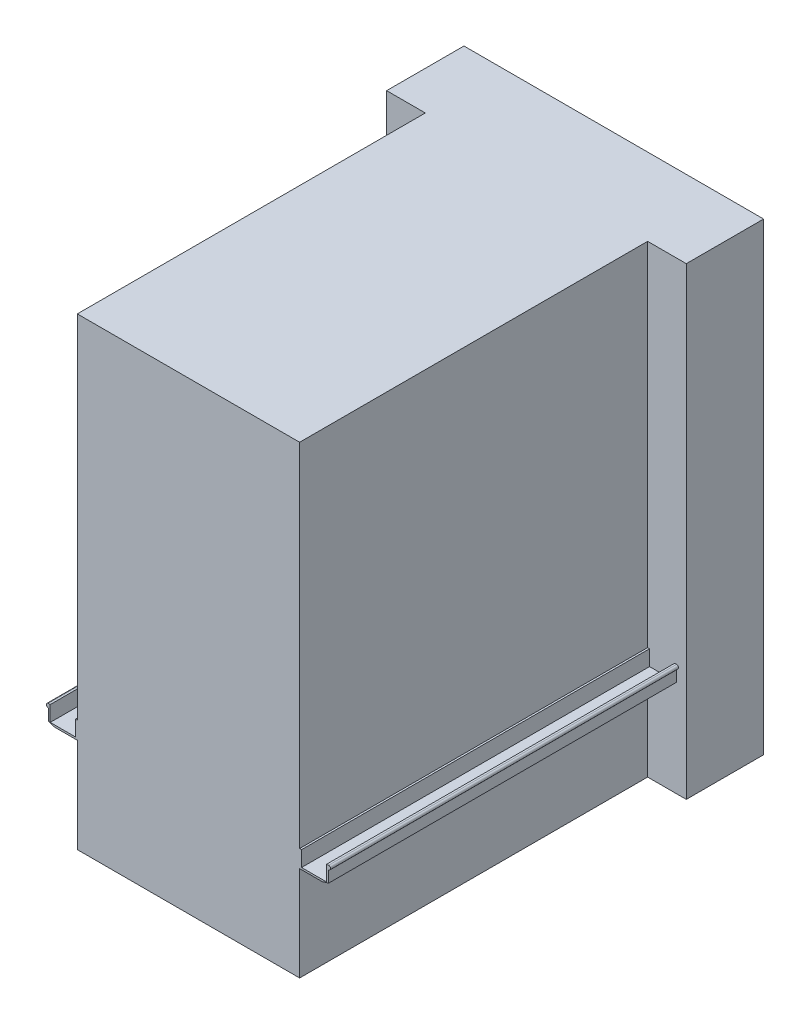
ISO-10303-21;
HEADER;
FILE_DESCRIPTION(('STEP AP214'),'2;1');
FILE_NAME('part.step','',(''),(''),'','','');
FILE_SCHEMA(('AUTOMOTIVE_DESIGN { 1 0 10303 214 1 1 1 1 }'));
ENDSEC;
DATA;
#1=APPLICATION_CONTEXT('core data for automotive mechanical design processes');
#2=APPLICATION_PROTOCOL_DEFINITION('international standard','automotive_design',2000,#1);
#3=PRODUCT_CONTEXT('',#1,'mechanical');
#4=PRODUCT('Part','Part','',(#3));
#5=PRODUCT_RELATED_PRODUCT_CATEGORY('part','',(#4));
#6=PRODUCT_DEFINITION_FORMATION('','',#4);
#7=PRODUCT_DEFINITION_CONTEXT('part definition',#1,'design');
#8=PRODUCT_DEFINITION('design','',#6,#7);
#9=PRODUCT_DEFINITION_SHAPE('','',#8);
#10=(LENGTH_UNIT() NAMED_UNIT(*) SI_UNIT(.MILLI.,.METRE.));
#11=(NAMED_UNIT(*) PLANE_ANGLE_UNIT() SI_UNIT($,.RADIAN.));
#12=(NAMED_UNIT(*) SI_UNIT($,.STERADIAN.) SOLID_ANGLE_UNIT());
#13=UNCERTAINTY_MEASURE_WITH_UNIT(LENGTH_MEASURE(1.E-05),#10,'distance_accuracy_value','');
#14=(GEOMETRIC_REPRESENTATION_CONTEXT(3) GLOBAL_UNCERTAINTY_ASSIGNED_CONTEXT((#13)) GLOBAL_UNIT_ASSIGNED_CONTEXT((#10,
#11,#12)) REPRESENTATION_CONTEXT('',''));
#15=CARTESIAN_POINT('',(0.,0.,0.));
#16=DIRECTION('',(0.,0.,1.));
#17=DIRECTION('',(1.,0.,0.));
#18=AXIS2_PLACEMENT_3D('',#15,#16,#17);
#19=CARTESIAN_POINT('',(0.,329.458185741184,1800.));
#20=DIRECTION('',(0.,1.,0.));
#21=DIRECTION('',(0.,0.,1.));
#22=AXIS2_PLACEMENT_3D('',#19,#20,#21);
#23=PLANE('',#22);
#24=DIRECTION('',(1.,0.,0.));
#25=VECTOR('',#24,1.);
#26=CARTESIAN_POINT('',(0.,329.458185741184,0.));
#27=LINE('',#26,#25);
#28=CARTESIAN_POINT('',(-724.999999999999,329.458185741184,0.));
#29=VERTEX_POINT('',#28);
#30=CARTESIAN_POINT('',(-715.049185759595,329.458185741184,0.));
#31=VERTEX_POINT('',#30);
#32=EDGE_CURVE('E243',#29,#31,#27,.T.);
#33=ORIENTED_EDGE('',*,*,#32,.F.);
#34=DIRECTION('',(0.,0.,-1.));
#35=VECTOR('',#34,1.);
#36=CARTESIAN_POINT('',(-724.999999999999,329.458185741184,1800.));
#37=LINE('',#36,#35);
#38=CARTESIAN_POINT('',(-724.999999999999,329.458185741184,1800.));
#39=VERTEX_POINT('',#38);
#40=EDGE_CURVE('E11',#39,#29,#37,.T.);
#41=ORIENTED_EDGE('',*,*,#40,.F.);
#42=DIRECTION('',(1.,0.,0.));
#43=VECTOR('',#42,1.);
#44=CARTESIAN_POINT('',(0.,329.458185741184,1800.));
#45=LINE('',#44,#43);
#46=CARTESIAN_POINT('',(-715.049185759595,329.458185741184,1800.));
#47=VERTEX_POINT('',#46);
#48=EDGE_CURVE('E251',#39,#47,#45,.T.);
#49=ORIENTED_EDGE('',*,*,#48,.T.);
#50=DIRECTION('',(0.,0.,-1.));
#51=VECTOR('',#50,1.);
#52=CARTESIAN_POINT('',(-715.049185759595,329.458185741184,1800.));
#53=LINE('',#52,#51);
#54=EDGE_CURVE('E50',#47,#31,#53,.T.);
#55=ORIENTED_EDGE('',*,*,#54,.T.);
#56=EDGE_LOOP('',(#33,#41,#49,#55));
#57=FACE_BOUND('',#56,.T.);
#58=ADVANCED_FACE('F35',(#57),#23,.T.);
#59=CARTESIAN_POINT('',(-724.999999999999,319.458185741184,1800.));
#60=DIRECTION('',(0.,0.,-1.));
#61=DIRECTION('',(-1.,0.,0.));
#62=AXIS2_PLACEMENT_3D('',#59,#60,#61);
#63=CYLINDRICAL_SURFACE('',#62,10.);
#64=CARTESIAN_POINT('',(-724.999999999999,319.458185741184,0.));
#65=DIRECTION('',(0.,0.,1.));
#66=DIRECTION('',(1.,0.,0.));
#67=AXIS2_PLACEMENT_3D('',#64,#65,#66);
#68=CIRCLE('',#67,10.);
#69=CARTESIAN_POINT('',(-724.999999999999,309.458185741184,0.));
#70=VERTEX_POINT('',#69);
#71=EDGE_CURVE('E245',#29,#70,#68,.T.);
#72=ORIENTED_EDGE('',*,*,#71,.T.);
#73=DIRECTION('',(0.,0.,-1.));
#74=VECTOR('',#73,1.);
#75=CARTESIAN_POINT('',(-724.999999999999,309.458185741184,1800.));
#76=LINE('',#75,#74);
#77=CARTESIAN_POINT('',(-724.999999999999,309.458185741184,1800.));
#78=VERTEX_POINT('',#77);
#79=EDGE_CURVE('E43',#78,#70,#76,.T.);
#80=ORIENTED_EDGE('',*,*,#79,.F.);
#81=CARTESIAN_POINT('',(-724.999999999999,319.458185741184,1800.));
#82=DIRECTION('',(0.,0.,1.));
#83=DIRECTION('',(1.,0.,0.));
#84=AXIS2_PLACEMENT_3D('',#81,#82,#83);
#85=CIRCLE('',#84,10.);
#86=EDGE_CURVE('E253',#39,#78,#85,.T.);
#87=ORIENTED_EDGE('',*,*,#86,.F.);
#88=ORIENTED_EDGE('',*,*,#40,.T.);
#89=EDGE_LOOP('',(#72,#80,#87,#88));
#90=FACE_BOUND('',#89,.T.);
#91=ADVANCED_FACE('F432',(#90),#63,.T.);
#92=CARTESIAN_POINT('',(-724.999999999999,0.,1800.));
#93=DIRECTION('',(1.,0.,0.));
#94=DIRECTION('',(0.,0.,-1.));
#95=AXIS2_PLACEMENT_3D('',#92,#93,#94);
#96=PLANE('',#95);
#97=DIRECTION('',(0.,-1.,0.));
#98=VECTOR('',#97,1.);
#99=CARTESIAN_POINT('',(-724.999999999999,0.,0.));
#100=LINE('',#99,#98);
#101=CARTESIAN_POINT('',(-724.999999999999,249.458185741184,0.));
#102=VERTEX_POINT('',#101);
#103=EDGE_CURVE('E312',#70,#102,#100,.T.);
#104=ORIENTED_EDGE('',*,*,#103,.T.);
#105=DIRECTION('',(0.,0.,-1.));
#106=VECTOR('',#105,1.);
#107=CARTESIAN_POINT('',(-724.999999999999,249.458185741184,1800.));
#108=LINE('',#107,#106);
#109=CARTESIAN_POINT('',(-724.999999999999,249.458185741184,1800.));
#110=VERTEX_POINT('',#109);
#111=EDGE_CURVE('E421',#110,#102,#108,.T.);
#112=ORIENTED_EDGE('',*,*,#111,.F.);
#113=DIRECTION('',(0.,-1.,0.));
#114=VECTOR('',#113,1.);
#115=CARTESIAN_POINT('',(-724.999999999999,0.,1800.));
#116=LINE('',#115,#114);
#117=EDGE_CURVE('E256',#78,#110,#116,.T.);
#118=ORIENTED_EDGE('',*,*,#117,.F.);
#119=ORIENTED_EDGE('',*,*,#79,.T.);
#120=EDGE_LOOP('',(#104,#112,#118,#119));
#121=FACE_BOUND('',#120,.T.);
#122=ADVANCED_FACE('F427',(#121),#96,.F.);
#123=CARTESIAN_POINT('',(8.21719993486013,27.0953165389469,1800.));
#124=DIRECTION('',(0.290217583337057,0.956960685881086,0.));
#125=DIRECTION('',(-0.956960685881086,0.290217583337057,0.));
#126=AXIS2_PLACEMENT_3D('',#123,#124,#125);
#127=PLANE('',#126);
#128=DIRECTION('',(0.956960685881086,-0.290217583337057,0.));
#129=VECTOR('',#128,1.);
#130=CARTESIAN_POINT('',(8.21719993486013,27.0953165389469,0.));
#131=LINE('',#130,#129);
#132=CARTESIAN_POINT('',(-692.026095563283,239.458185741184,0.));
#133=VERTEX_POINT('',#132);
#134=EDGE_CURVE('E315',#102,#133,#131,.T.);
#135=ORIENTED_EDGE('',*,*,#134,.T.);
#136=DIRECTION('',(0.,0.,-1.));
#137=VECTOR('',#136,1.);
#138=CARTESIAN_POINT('',(-692.026095563283,239.458185741184,1800.));
#139=LINE('',#138,#137);
#140=CARTESIAN_POINT('',(-692.026095563283,239.458185741184,1800.));
#141=VERTEX_POINT('',#140);
#142=EDGE_CURVE('E418',#141,#133,#139,.T.);
#143=ORIENTED_EDGE('',*,*,#142,.F.);
#144=DIRECTION('',(0.956960685881086,-0.290217583337057,0.));
#145=VECTOR('',#144,1.);
#146=CARTESIAN_POINT('',(8.21719993486013,27.0953165389469,1800.));
#147=LINE('',#146,#145);
#148=EDGE_CURVE('E258',#110,#141,#147,.T.);
#149=ORIENTED_EDGE('',*,*,#148,.F.);
#150=ORIENTED_EDGE('',*,*,#111,.T.);
#151=EDGE_LOOP('',(#135,#143,#149,#150));
#152=FACE_BOUND('',#151,.T.);
#153=ADVANCED_FACE('F439',(#152),#127,.F.);
#154=CARTESIAN_POINT('',(0.,239.458185741184,1800.));
#155=DIRECTION('',(0.,1.,0.));
#156=DIRECTION('',(0.,0.,1.));
#157=AXIS2_PLACEMENT_3D('',#154,#155,#156);
#158=PLANE('',#157);
#159=DIRECTION('',(1.,0.,0.));
#160=VECTOR('',#159,1.);
#161=CARTESIAN_POINT('',(0.,239.458185741184,0.));
#162=LINE('',#161,#160);
#163=CARTESIAN_POINT('',(-575.,239.458185741184,0.));
#164=VERTEX_POINT('',#163);
#165=EDGE_CURVE('E318',#133,#164,#162,.T.);
#166=ORIENTED_EDGE('',*,*,#165,.T.);
#167=DIRECTION('',(0.,0.,-1.));
#168=VECTOR('',#167,1.);
#169=CARTESIAN_POINT('',(-575.,239.458185741184,1800.));
#170=LINE('',#169,#168);
#171=CARTESIAN_POINT('',(-575.,239.458185741184,1800.));
#172=VERTEX_POINT('',#171);
#173=EDGE_CURVE('E415',#172,#164,#170,.T.);
#174=ORIENTED_EDGE('',*,*,#173,.F.);
#175=DIRECTION('',(1.,0.,0.));
#176=VECTOR('',#175,1.);
#177=CARTESIAN_POINT('',(0.,239.458185741184,1800.));
#178=LINE('',#177,#176);
#179=EDGE_CURVE('E260',#141,#172,#178,.T.);
#180=ORIENTED_EDGE('',*,*,#179,.F.);
#181=ORIENTED_EDGE('',*,*,#142,.T.);
#182=EDGE_LOOP('',(#166,#174,#180,#181));
#183=FACE_BOUND('',#182,.T.);
#184=ADVANCED_FACE('F443',(#183),#158,.F.);
#185=CARTESIAN_POINT('',(-575.,-2.605625465957E-13,1800.));
#186=DIRECTION('',(1.,0.,0.));
#187=DIRECTION('',(0.,1.,0.));
#188=AXIS2_PLACEMENT_3D('',#185,#186,#187);
#189=PLANE('',#188);
#190=DIRECTION('',(0.,-1.,0.));
#191=VECTOR('',#190,1.);
#192=CARTESIAN_POINT('',(-575.,-2.605625465957E-13,0.));
#193=LINE('',#192,#191);
#194=CARTESIAN_POINT('',(-575.,-250.541814258816,0.));
#195=VERTEX_POINT('',#194);
#196=EDGE_CURVE('E321',#164,#195,#193,.T.);
#197=ORIENTED_EDGE('',*,*,#196,.T.);
#198=DIRECTION('',(0.,0.,-1.));
#199=VECTOR('',#198,1.);
#200=CARTESIAN_POINT('',(-575.,-250.541814258816,1800.));
#201=LINE('',#200,#199);
#202=CARTESIAN_POINT('',(-575.,-250.541814258816,1800.));
#203=VERTEX_POINT('',#202);
#204=EDGE_CURVE('E412',#203,#195,#201,.T.);
#205=ORIENTED_EDGE('',*,*,#204,.F.);
#206=DIRECTION('',(0.,-1.,0.));
#207=VECTOR('',#206,1.);
#208=CARTESIAN_POINT('',(-575.,-2.605625465957E-13,1800.));
#209=LINE('',#208,#207);
#210=EDGE_CURVE('E262',#172,#203,#209,.T.);
#211=ORIENTED_EDGE('',*,*,#210,.F.);
#212=ORIENTED_EDGE('',*,*,#173,.T.);
#213=EDGE_LOOP('',(#197,#205,#211,#212));
#214=FACE_BOUND('',#213,.T.);
#215=ADVANCED_FACE('F557',(#214),#189,.F.);
#216=CARTESIAN_POINT('',(0.,-250.541814258816,1800.));
#217=DIRECTION('',(0.,1.,0.));
#218=DIRECTION('',(-1.,0.,0.));
#219=AXIS2_PLACEMENT_3D('',#216,#217,#218);
#220=PLANE('',#219);
#221=ORIENTED_EDGE('',*,*,#204,.T.);
#222=DIRECTION('',(-1.,0.,0.));
#223=VECTOR('',#222,1.);
#224=CARTESIAN_POINT('',(775.,-250.541814258816,0.));
#225=LINE('',#224,#223);
#226=CARTESIAN_POINT('',(-775.,-250.541814258816,0.));
#227=VERTEX_POINT('',#226);
#228=EDGE_CURVE('E486',#195,#227,#225,.T.);
#229=ORIENTED_EDGE('',*,*,#228,.T.);
#230=DIRECTION('',(0.,0.,1.));
#231=VECTOR('',#230,1.);
#232=CARTESIAN_POINT('',(-775.,-250.541814258816,-400.));
#233=LINE('',#232,#231);
#234=CARTESIAN_POINT('',(-775.,-250.541814258816,-400.));
#235=VERTEX_POINT('',#234);
#236=EDGE_CURVE('E489',#235,#227,#233,.T.);
#237=ORIENTED_EDGE('',*,*,#236,.F.);
#238=DIRECTION('',(-1.,0.,0.));
#239=VECTOR('',#238,1.);
#240=CARTESIAN_POINT('',(775.,-250.541814258816,-400.));
#241=LINE('',#240,#239);
#242=CARTESIAN_POINT('',(775.,-250.541814258816,-400.));
#243=VERTEX_POINT('',#242);
#244=EDGE_CURVE('E234',#243,#235,#241,.T.);
#245=ORIENTED_EDGE('',*,*,#244,.F.);
#246=DIRECTION('',(0.,0.,1.));
#247=VECTOR('',#246,1.);
#248=CARTESIAN_POINT('',(775.,-250.541814258816,-400.));
#249=LINE('',#248,#247);
#250=CARTESIAN_POINT('',(775.,-250.541814258816,0.));
#251=VERTEX_POINT('',#250);
#252=EDGE_CURVE('E247',#243,#251,#249,.T.);
#253=ORIENTED_EDGE('',*,*,#252,.T.);
#254=CARTESIAN_POINT('',(575.,-250.541814258816,0.));
#255=VERTEX_POINT('',#254);
#256=EDGE_CURVE('E238',#251,#255,#225,.T.);
#257=ORIENTED_EDGE('',*,*,#256,.T.);
#258=DIRECTION('',(0.,0.,-1.));
#259=VECTOR('',#258,1.);
#260=CARTESIAN_POINT('',(575.,-250.541814258816,1800.));
#261=LINE('',#260,#259);
#262=CARTESIAN_POINT('',(575.,-250.541814258816,1800.));
#263=VERTEX_POINT('',#262);
#264=EDGE_CURVE('E409',#263,#255,#261,.T.);
#265=ORIENTED_EDGE('',*,*,#264,.F.);
#266=DIRECTION('',(1.,0.,0.));
#267=VECTOR('',#266,1.);
#268=CARTESIAN_POINT('',(0.,-250.541814258816,1800.));
#269=LINE('',#268,#267);
#270=EDGE_CURVE('E264',#203,#263,#269,.T.);
#271=ORIENTED_EDGE('',*,*,#270,.F.);
#272=EDGE_LOOP('',(#221,#229,#237,#245,#253,#257,#265,#271));
#273=FACE_BOUND('',#272,.T.);
#274=ADVANCED_FACE('F493',(#273),#220,.F.);
#275=CARTESIAN_POINT('',(575.,-2.605625465957E-13,1800.));
#276=DIRECTION('',(1.,0.,0.));
#277=DIRECTION('',(0.,1.,0.));
#278=AXIS2_PLACEMENT_3D('',#275,#276,#277);
#279=PLANE('',#278);
#280=DIRECTION('',(0.,-1.,0.));
#281=VECTOR('',#280,1.);
#282=CARTESIAN_POINT('',(575.,-2.605625465957E-13,0.));
#283=LINE('',#282,#281);
#284=CARTESIAN_POINT('',(575.,239.458185741184,0.));
#285=VERTEX_POINT('',#284);
#286=EDGE_CURVE('E324',#285,#255,#283,.T.);
#287=ORIENTED_EDGE('',*,*,#286,.F.);
#288=DIRECTION('',(0.,0.,-1.));
#289=VECTOR('',#288,1.);
#290=CARTESIAN_POINT('',(575.,239.458185741184,1800.));
#291=LINE('',#290,#289);
#292=CARTESIAN_POINT('',(575.,239.458185741184,1800.));
#293=VERTEX_POINT('',#292);
#294=EDGE_CURVE('E406',#293,#285,#291,.T.);
#295=ORIENTED_EDGE('',*,*,#294,.F.);
#296=DIRECTION('',(0.,-1.,0.));
#297=VECTOR('',#296,1.);
#298=CARTESIAN_POINT('',(575.,-2.605625465957E-13,1800.));
#299=LINE('',#298,#297);
#300=EDGE_CURVE('E266',#293,#263,#299,.T.);
#301=ORIENTED_EDGE('',*,*,#300,.T.);
#302=ORIENTED_EDGE('',*,*,#264,.T.);
#303=EDGE_LOOP('',(#287,#295,#301,#302));
#304=FACE_BOUND('',#303,.T.);
#305=ADVANCED_FACE('F499',(#304),#279,.T.);
#306=CARTESIAN_POINT('',(0.,239.458185741184,1800.));
#307=DIRECTION('',(0.,-1.,0.));
#308=DIRECTION('',(1.,0.,0.));
#309=AXIS2_PLACEMENT_3D('',#306,#307,#308);
#310=PLANE('',#309);
#311=DIRECTION('',(-1.,0.,0.));
#312=VECTOR('',#311,1.);
#313=CARTESIAN_POINT('',(0.,239.458185741184,0.));
#314=LINE('',#313,#312);
#315=CARTESIAN_POINT('',(692.026095563284,239.458185741184,0.));
#316=VERTEX_POINT('',#315);
#317=EDGE_CURVE('E326',#316,#285,#314,.T.);
#318=ORIENTED_EDGE('',*,*,#317,.F.);
#319=DIRECTION('',(0.,0.,-1.));
#320=VECTOR('',#319,1.);
#321=CARTESIAN_POINT('',(692.026095563284,239.458185741184,1800.));
#322=LINE('',#321,#320);
#323=CARTESIAN_POINT('',(692.026095563284,239.458185741184,1800.));
#324=VERTEX_POINT('',#323);
#325=EDGE_CURVE('E403',#324,#316,#322,.T.);
#326=ORIENTED_EDGE('',*,*,#325,.F.);
#327=DIRECTION('',(-1.,0.,0.));
#328=VECTOR('',#327,1.);
#329=CARTESIAN_POINT('',(0.,239.458185741184,1800.));
#330=LINE('',#329,#328);
#331=EDGE_CURVE('E269',#324,#293,#330,.T.);
#332=ORIENTED_EDGE('',*,*,#331,.T.);
#333=ORIENTED_EDGE('',*,*,#294,.T.);
#334=EDGE_LOOP('',(#318,#326,#332,#333));
#335=FACE_BOUND('',#334,.T.);
#336=ADVANCED_FACE('F505',(#335),#310,.T.);
#337=CARTESIAN_POINT('',(-8.21719993486011,27.0953165389469,1800.));
#338=DIRECTION('',(0.290217583337057,-0.956960685881086,0.));
#339=DIRECTION('',(0.956960685881086,0.290217583337057,0.));
#340=AXIS2_PLACEMENT_3D('',#337,#338,#339);
#341=PLANE('',#340);
#342=DIRECTION('',(-0.956960685881086,-0.290217583337057,0.));
#343=VECTOR('',#342,1.);
#344=CARTESIAN_POINT('',(-8.21719993486011,27.0953165389469,0.));
#345=LINE('',#344,#343);
#346=CARTESIAN_POINT('',(725.,249.458185741184,0.));
#347=VERTEX_POINT('',#346);
#348=EDGE_CURVE('E328',#347,#316,#345,.T.);
#349=ORIENTED_EDGE('',*,*,#348,.F.);
#350=DIRECTION('',(0.,0.,-1.));
#351=VECTOR('',#350,1.);
#352=CARTESIAN_POINT('',(725.,249.458185741184,1800.));
#353=LINE('',#352,#351);
#354=CARTESIAN_POINT('',(725.,249.458185741184,1800.));
#355=VERTEX_POINT('',#354);
#356=EDGE_CURVE('E400',#355,#347,#353,.T.);
#357=ORIENTED_EDGE('',*,*,#356,.F.);
#358=DIRECTION('',(-0.956960685881086,-0.290217583337057,0.));
#359=VECTOR('',#358,1.);
#360=CARTESIAN_POINT('',(-8.21719993486011,27.0953165389469,1800.));
#361=LINE('',#360,#359);
#362=EDGE_CURVE('E272',#355,#324,#361,.T.);
#363=ORIENTED_EDGE('',*,*,#362,.T.);
#364=ORIENTED_EDGE('',*,*,#325,.T.);
#365=EDGE_LOOP('',(#349,#357,#363,#364));
#366=FACE_BOUND('',#365,.T.);
#367=ADVANCED_FACE('F508',(#366),#341,.T.);
#368=CARTESIAN_POINT('',(725.,0.,1800.));
#369=DIRECTION('',(1.,0.,0.));
#370=DIRECTION('',(0.,0.,-1.));
#371=AXIS2_PLACEMENT_3D('',#368,#369,#370);
#372=PLANE('',#371);
#373=DIRECTION('',(0.,-1.,0.));
#374=VECTOR('',#373,1.);
#375=CARTESIAN_POINT('',(725.,0.,0.));
#376=LINE('',#375,#374);
#377=CARTESIAN_POINT('',(725.,309.458185741184,0.));
#378=VERTEX_POINT('',#377);
#379=EDGE_CURVE('E330',#378,#347,#376,.T.);
#380=ORIENTED_EDGE('',*,*,#379,.F.);
#381=DIRECTION('',(0.,0.,-1.));
#382=VECTOR('',#381,1.);
#383=CARTESIAN_POINT('',(725.,309.458185741184,1800.));
#384=LINE('',#383,#382);
#385=CARTESIAN_POINT('',(725.,309.458185741184,1800.));
#386=VERTEX_POINT('',#385);
#387=EDGE_CURVE('E397',#386,#378,#384,.T.);
#388=ORIENTED_EDGE('',*,*,#387,.F.);
#389=DIRECTION('',(0.,-1.,0.));
#390=VECTOR('',#389,1.);
#391=CARTESIAN_POINT('',(725.,0.,1800.));
#392=LINE('',#391,#390);
#393=EDGE_CURVE('E275',#386,#355,#392,.T.);
#394=ORIENTED_EDGE('',*,*,#393,.T.);
#395=ORIENTED_EDGE('',*,*,#356,.T.);
#396=EDGE_LOOP('',(#380,#388,#394,#395));
#397=FACE_BOUND('',#396,.T.);
#398=ADVANCED_FACE('F513',(#397),#372,.T.);
#399=CARTESIAN_POINT('',(725.,319.458185741184,1800.));
#400=DIRECTION('',(0.,0.,-1.));
#401=DIRECTION('',(-1.,0.,0.));
#402=AXIS2_PLACEMENT_3D('',#399,#400,#401);
#403=CYLINDRICAL_SURFACE('',#402,10.);
#404=CARTESIAN_POINT('',(725.,319.458185741184,0.));
#405=DIRECTION('',(0.,0.,1.));
#406=DIRECTION('',(1.,0.,0.));
#407=AXIS2_PLACEMENT_3D('',#404,#405,#406);
#408=CIRCLE('',#407,10.);
#409=CARTESIAN_POINT('',(725.,329.458185741184,0.));
#410=VERTEX_POINT('',#409);
#411=EDGE_CURVE('E332',#410,#378,#408,.F.);
#412=ORIENTED_EDGE('',*,*,#411,.F.);
#413=DIRECTION('',(0.,0.,-1.));
#414=VECTOR('',#413,1.);
#415=CARTESIAN_POINT('',(725.,329.458185741184,1800.));
#416=LINE('',#415,#414);
#417=CARTESIAN_POINT('',(725.,329.458185741184,1800.));
#418=VERTEX_POINT('',#417);
#419=EDGE_CURVE('E394',#418,#410,#416,.T.);
#420=ORIENTED_EDGE('',*,*,#419,.F.);
#421=CARTESIAN_POINT('',(725.,319.458185741184,1800.));
#422=DIRECTION('',(0.,0.,1.));
#423=DIRECTION('',(1.,0.,0.));
#424=AXIS2_PLACEMENT_3D('',#421,#422,#423);
#425=CIRCLE('',#424,10.);
#426=EDGE_CURVE('E278',#418,#386,#425,.F.);
#427=ORIENTED_EDGE('',*,*,#426,.T.);
#428=ORIENTED_EDGE('',*,*,#387,.T.);
#429=EDGE_LOOP('',(#412,#420,#427,#428));
#430=FACE_BOUND('',#429,.T.);
#431=ADVANCED_FACE('F516',(#430),#403,.T.);
#432=CARTESIAN_POINT('',(0.,329.458185741184,1800.));
#433=DIRECTION('',(0.,-1.,0.));
#434=DIRECTION('',(0.,0.,-1.));
#435=AXIS2_PLACEMENT_3D('',#432,#433,#434);
#436=PLANE('',#435);
#437=DIRECTION('',(-1.,0.,0.));
#438=VECTOR('',#437,1.);
#439=CARTESIAN_POINT('',(0.,329.458185741184,0.));
#440=LINE('',#439,#438);
#441=CARTESIAN_POINT('',(715.049185759596,329.458185741184,0.));
#442=VERTEX_POINT('',#441);
#443=EDGE_CURVE('E334',#410,#442,#440,.T.);
#444=ORIENTED_EDGE('',*,*,#443,.T.);
#445=DIRECTION('',(0.,0.,-1.));
#446=VECTOR('',#445,1.);
#447=CARTESIAN_POINT('',(715.049185759596,329.458185741184,1800.));
#448=LINE('',#447,#446);
#449=CARTESIAN_POINT('',(715.049185759596,329.458185741184,1800.));
#450=VERTEX_POINT('',#449);
#451=EDGE_CURVE('E391',#450,#442,#448,.T.);
#452=ORIENTED_EDGE('',*,*,#451,.F.);
#453=DIRECTION('',(-1.,0.,0.));
#454=VECTOR('',#453,1.);
#455=CARTESIAN_POINT('',(0.,329.458185741184,1800.));
#456=LINE('',#455,#454);
#457=EDGE_CURVE('E281',#418,#450,#456,.T.);
#458=ORIENTED_EDGE('',*,*,#457,.F.);
#459=ORIENTED_EDGE('',*,*,#419,.T.);
#460=EDGE_LOOP('',(#444,#452,#458,#459));
#461=FACE_BOUND('',#460,.T.);
#462=ADVANCED_FACE('F522',(#461),#436,.F.);
#463=CARTESIAN_POINT('',(715.049185759597,1.98344071144935E-12,1800.));
#464=DIRECTION('',(1.,0.,0.));
#465=DIRECTION('',(0.,1.,0.));
#466=AXIS2_PLACEMENT_3D('',#463,#464,#465);
#467=PLANE('',#466);
#468=DIRECTION('',(0.,-1.,0.));
#469=VECTOR('',#468,1.);
#470=CARTESIAN_POINT('',(715.049185759597,1.98344071144935E-12,0.));
#471=LINE('',#470,#469);
#472=CARTESIAN_POINT('',(715.049185759596,249.408999981588,0.));
#473=VERTEX_POINT('',#472);
#474=EDGE_CURVE('E337',#442,#473,#471,.T.);
#475=ORIENTED_EDGE('',*,*,#474,.T.);
#476=DIRECTION('',(0.,0.,-1.));
#477=VECTOR('',#476,1.);
#478=CARTESIAN_POINT('',(715.049185759596,249.408999981588,1800.));
#479=LINE('',#478,#477);
#480=CARTESIAN_POINT('',(715.049185759596,249.408999981588,1800.));
#481=VERTEX_POINT('',#480);
#482=EDGE_CURVE('E388',#481,#473,#479,.T.);
#483=ORIENTED_EDGE('',*,*,#482,.F.);
#484=DIRECTION('',(0.,-1.,0.));
#485=VECTOR('',#484,1.);
#486=CARTESIAN_POINT('',(715.049185759597,1.98344071144935E-12,1800.));
#487=LINE('',#486,#485);
#488=EDGE_CURVE('E283',#450,#481,#487,.T.);
#489=ORIENTED_EDGE('',*,*,#488,.F.);
#490=ORIENTED_EDGE('',*,*,#451,.T.);
#491=EDGE_LOOP('',(#475,#483,#489,#490));
#492=FACE_BOUND('',#491,.T.);
#493=ADVANCED_FACE('F524',(#492),#467,.F.);
#494=CARTESIAN_POINT('',(0.,249.408999981588,1800.));
#495=DIRECTION('',(0.,-1.,0.));
#496=DIRECTION('',(1.,0.,0.));
#497=AXIS2_PLACEMENT_3D('',#494,#495,#496);
#498=PLANE('',#497);
#499=DIRECTION('',(-1.,0.,0.));
#500=VECTOR('',#499,1.);
#501=CARTESIAN_POINT('',(0.,249.408999981588,0.));
#502=LINE('',#501,#500);
#503=CARTESIAN_POINT('',(584.950814240404,249.408999981588,0.));
#504=VERTEX_POINT('',#503);
#505=EDGE_CURVE('E340',#473,#504,#502,.T.);
#506=ORIENTED_EDGE('',*,*,#505,.T.);
#507=DIRECTION('',(0.,0.,-1.));
#508=VECTOR('',#507,1.);
#509=CARTESIAN_POINT('',(584.950814240404,249.408999981588,1800.));
#510=LINE('',#509,#508);
#511=CARTESIAN_POINT('',(584.950814240404,249.408999981588,1800.));
#512=VERTEX_POINT('',#511);
#513=EDGE_CURVE('E385',#512,#504,#510,.T.);
#514=ORIENTED_EDGE('',*,*,#513,.F.);
#515=DIRECTION('',(-1.,0.,0.));
#516=VECTOR('',#515,1.);
#517=CARTESIAN_POINT('',(0.,249.408999981588,1800.));
#518=LINE('',#517,#516);
#519=EDGE_CURVE('E285',#481,#512,#518,.T.);
#520=ORIENTED_EDGE('',*,*,#519,.F.);
#521=ORIENTED_EDGE('',*,*,#482,.T.);
#522=EDGE_LOOP('',(#506,#514,#520,#521));
#523=FACE_BOUND('',#522,.T.);
#524=ADVANCED_FACE('F528',(#523),#498,.F.);
#525=CARTESIAN_POINT('',(584.950814240404,8.11283532843527E-13,1800.));
#526=DIRECTION('',(1.,0.,0.));
#527=DIRECTION('',(0.,1.,0.));
#528=AXIS2_PLACEMENT_3D('',#525,#526,#527);
#529=PLANE('',#528);
#530=DIRECTION('',(0.,-1.,0.));
#531=VECTOR('',#530,1.);
#532=CARTESIAN_POINT('',(584.950814240404,8.11283532843527E-13,0.));
#533=LINE('',#532,#531);
#534=CARTESIAN_POINT('',(584.950814240404,329.458185741184,0.));
#535=VERTEX_POINT('',#534);
#536=EDGE_CURVE('E343',#535,#504,#533,.T.);
#537=ORIENTED_EDGE('',*,*,#536,.F.);
#538=DIRECTION('',(0.,0.,-1.));
#539=VECTOR('',#538,1.);
#540=CARTESIAN_POINT('',(584.950814240404,329.458185741184,1800.));
#541=LINE('',#540,#539);
#542=CARTESIAN_POINT('',(584.950814240404,329.458185741184,1800.));
#543=VERTEX_POINT('',#542);
#544=EDGE_CURVE('E382',#543,#535,#541,.T.);
#545=ORIENTED_EDGE('',*,*,#544,.F.);
#546=DIRECTION('',(0.,-1.,0.));
#547=VECTOR('',#546,1.);
#548=CARTESIAN_POINT('',(584.950814240404,8.11283532843527E-13,1800.));
#549=LINE('',#548,#547);
#550=EDGE_CURVE('E287',#543,#512,#549,.T.);
#551=ORIENTED_EDGE('',*,*,#550,.T.);
#552=ORIENTED_EDGE('',*,*,#513,.T.);
#553=EDGE_LOOP('',(#537,#545,#551,#552));
#554=FACE_BOUND('',#553,.T.);
#555=ADVANCED_FACE('F533',(#554),#529,.T.);
#556=CARTESIAN_POINT('',(0.,329.458185741184,1800.));
#557=DIRECTION('',(0.,-1.,0.));
#558=DIRECTION('',(0.,0.,-1.));
#559=AXIS2_PLACEMENT_3D('',#556,#557,#558);
#560=PLANE('',#559);
#561=DIRECTION('',(-1.,0.,0.));
#562=VECTOR('',#561,1.);
#563=CARTESIAN_POINT('',(0.,329.458185741184,0.));
#564=LINE('',#563,#562);
#565=CARTESIAN_POINT('',(575.,329.458185741184,0.));
#566=VERTEX_POINT('',#565);
#567=EDGE_CURVE('E345',#535,#566,#564,.T.);
#568=ORIENTED_EDGE('',*,*,#567,.T.);
#569=DIRECTION('',(0.,0.,-1.));
#570=VECTOR('',#569,1.);
#571=CARTESIAN_POINT('',(575.,329.458185741184,1800.));
#572=LINE('',#571,#570);
#573=CARTESIAN_POINT('',(575.,329.458185741184,1800.));
#574=VERTEX_POINT('',#573);
#575=EDGE_CURVE('E379',#574,#566,#572,.T.);
#576=ORIENTED_EDGE('',*,*,#575,.F.);
#577=DIRECTION('',(-1.,0.,0.));
#578=VECTOR('',#577,1.);
#579=CARTESIAN_POINT('',(0.,329.458185741184,1800.));
#580=LINE('',#579,#578);
#581=EDGE_CURVE('E290',#543,#574,#580,.T.);
#582=ORIENTED_EDGE('',*,*,#581,.F.);
#583=ORIENTED_EDGE('',*,*,#544,.T.);
#584=EDGE_LOOP('',(#568,#576,#582,#583));
#585=FACE_BOUND('',#584,.T.);
#586=ADVANCED_FACE('F535',(#585),#560,.F.);
#587=CARTESIAN_POINT('',(575.,1.05227182279033E-13,1800.));
#588=DIRECTION('',(1.,0.,0.));
#589=DIRECTION('',(0.,1.,0.));
#590=AXIS2_PLACEMENT_3D('',#587,#588,#589);
#591=PLANE('',#590);
#592=DIRECTION('',(0.,-1.,0.));
#593=VECTOR('',#592,1.);
#594=CARTESIAN_POINT('',(575.,1.05227182279033E-13,0.));
#595=LINE('',#594,#593);
#596=CARTESIAN_POINT('',(575.,2149.45818574118,0.));
#597=VERTEX_POINT('',#596);
#598=EDGE_CURVE('E348',#597,#566,#595,.T.);
#599=ORIENTED_EDGE('',*,*,#598,.F.);
#600=DIRECTION('',(0.,0.,-1.));
#601=VECTOR('',#600,1.);
#602=CARTESIAN_POINT('',(575.,2149.45818574118,1800.));
#603=LINE('',#602,#601);
#604=CARTESIAN_POINT('',(575.,2149.45818574118,1800.));
#605=VERTEX_POINT('',#604);
#606=EDGE_CURVE('E377',#605,#597,#603,.T.);
#607=ORIENTED_EDGE('',*,*,#606,.F.);
#608=DIRECTION('',(0.,-1.,0.));
#609=VECTOR('',#608,1.);
#610=CARTESIAN_POINT('',(575.,1.05227182279033E-13,1800.));
#611=LINE('',#610,#609);
#612=EDGE_CURVE('E292',#605,#574,#611,.T.);
#613=ORIENTED_EDGE('',*,*,#612,.T.);
#614=ORIENTED_EDGE('',*,*,#575,.T.);
#615=EDGE_LOOP('',(#599,#607,#613,#614));
#616=FACE_BOUND('',#615,.T.);
#617=ADVANCED_FACE('F476',(#616),#591,.T.);
#618=CARTESIAN_POINT('',(0.,2149.45818574118,1800.));
#619=DIRECTION('',(0.,1.,0.));
#620=DIRECTION('',(0.,0.,1.));
#621=AXIS2_PLACEMENT_3D('',#618,#619,#620);
#622=PLANE('',#621);
#623=ORIENTED_EDGE('',*,*,#606,.T.);
#624=DIRECTION('',(1.,0.,0.));
#625=VECTOR('',#624,1.);
#626=CARTESIAN_POINT('',(-775.,2149.45818574118,0.));
#627=LINE('',#626,#625);
#628=CARTESIAN_POINT('',(775.,2149.45818574118,0.));
#629=VERTEX_POINT('',#628);
#630=EDGE_CURVE('E469',#597,#629,#627,.T.);
#631=ORIENTED_EDGE('',*,*,#630,.T.);
#632=DIRECTION('',(0.,0.,1.));
#633=VECTOR('',#632,1.);
#634=CARTESIAN_POINT('',(775.,2149.45818574118,-400.));
#635=LINE('',#634,#633);
#636=CARTESIAN_POINT('',(775.,2149.45818574118,-400.));
#637=VERTEX_POINT('',#636);
#638=EDGE_CURVE('E225',#637,#629,#635,.T.);
#639=ORIENTED_EDGE('',*,*,#638,.F.);
#640=DIRECTION('',(1.,0.,0.));
#641=VECTOR('',#640,1.);
#642=CARTESIAN_POINT('',(-775.,2149.45818574118,-400.));
#643=LINE('',#642,#641);
#644=CARTESIAN_POINT('',(-775.,2149.45818574118,-400.));
#645=VERTEX_POINT('',#644);
#646=EDGE_CURVE('E216',#645,#637,#643,.T.);
#647=ORIENTED_EDGE('',*,*,#646,.F.);
#648=DIRECTION('',(0.,0.,1.));
#649=VECTOR('',#648,1.);
#650=CARTESIAN_POINT('',(-775.,2149.45818574118,-400.));
#651=LINE('',#650,#649);
#652=CARTESIAN_POINT('',(-775.,2149.45818574118,0.));
#653=VERTEX_POINT('',#652);
#654=EDGE_CURVE('E222',#645,#653,#651,.T.);
#655=ORIENTED_EDGE('',*,*,#654,.T.);
#656=CARTESIAN_POINT('',(-575.,2149.45818574118,0.));
#657=VERTEX_POINT('',#656);
#658=EDGE_CURVE('E465',#653,#657,#627,.T.);
#659=ORIENTED_EDGE('',*,*,#658,.T.);
#660=DIRECTION('',(0.,0.,-1.));
#661=VECTOR('',#660,1.);
#662=CARTESIAN_POINT('',(-575.,2149.45818574118,1800.));
#663=LINE('',#662,#661);
#664=CARTESIAN_POINT('',(-575.,2149.45818574118,1800.));
#665=VERTEX_POINT('',#664);
#666=EDGE_CURVE('E374',#665,#657,#663,.T.);
#667=ORIENTED_EDGE('',*,*,#666,.F.);
#668=DIRECTION('',(1.,0.,0.));
#669=VECTOR('',#668,1.);
#670=CARTESIAN_POINT('',(0.,2149.45818574118,1800.));
#671=LINE('',#670,#669);
#672=EDGE_CURVE('E295',#665,#605,#671,.T.);
#673=ORIENTED_EDGE('',*,*,#672,.T.);
#674=EDGE_LOOP('',(#623,#631,#639,#647,#655,#659,#667,#673));
#675=FACE_BOUND('',#674,.T.);
#676=ADVANCED_FACE('F219',(#675),#622,.T.);
#677=CARTESIAN_POINT('',(-575.,0.,1800.));
#678=DIRECTION('',(1.,0.,0.));
#679=DIRECTION('',(0.,1.,0.));
#680=AXIS2_PLACEMENT_3D('',#677,#678,#679);
#681=PLANE('',#680);
#682=DIRECTION('',(0.,-1.,0.));
#683=VECTOR('',#682,1.);
#684=CARTESIAN_POINT('',(-575.,0.,0.));
#685=LINE('',#684,#683);
#686=CARTESIAN_POINT('',(-575.,329.458185741184,0.));
#687=VERTEX_POINT('',#686);
#688=EDGE_CURVE('E350',#657,#687,#685,.T.);
#689=ORIENTED_EDGE('',*,*,#688,.T.);
#690=DIRECTION('',(0.,0.,-1.));
#691=VECTOR('',#690,1.);
#692=CARTESIAN_POINT('',(-575.,329.458185741184,1800.));
#693=LINE('',#692,#691);
#694=CARTESIAN_POINT('',(-575.,329.458185741184,1800.));
#695=VERTEX_POINT('',#694);
#696=EDGE_CURVE('E371',#695,#687,#693,.T.);
#697=ORIENTED_EDGE('',*,*,#696,.F.);
#698=DIRECTION('',(0.,-1.,0.));
#699=VECTOR('',#698,1.);
#700=CARTESIAN_POINT('',(-575.,0.,1800.));
#701=LINE('',#700,#699);
#702=EDGE_CURVE('E298',#665,#695,#701,.T.);
#703=ORIENTED_EDGE('',*,*,#702,.F.);
#704=ORIENTED_EDGE('',*,*,#666,.T.);
#705=EDGE_LOOP('',(#689,#697,#703,#704));
#706=FACE_BOUND('',#705,.T.);
#707=ADVANCED_FACE('F471',(#706),#681,.F.);
#708=CARTESIAN_POINT('',(0.,329.458185741184,1800.));
#709=DIRECTION('',(0.,1.,0.));
#710=DIRECTION('',(0.,0.,1.));
#711=AXIS2_PLACEMENT_3D('',#708,#709,#710);
#712=PLANE('',#711);
#713=DIRECTION('',(1.,0.,0.));
#714=VECTOR('',#713,1.);
#715=CARTESIAN_POINT('',(0.,329.458185741184,0.));
#716=LINE('',#715,#714);
#717=CARTESIAN_POINT('',(-584.950814240404,329.458185741184,0.));
#718=VERTEX_POINT('',#717);
#719=EDGE_CURVE('E353',#718,#687,#716,.T.);
#720=ORIENTED_EDGE('',*,*,#719,.F.);
#721=DIRECTION('',(0.,0.,-1.));
#722=VECTOR('',#721,1.);
#723=CARTESIAN_POINT('',(-584.950814240404,329.458185741184,1800.));
#724=LINE('',#723,#722);
#725=CARTESIAN_POINT('',(-584.950814240404,329.458185741184,1800.));
#726=VERTEX_POINT('',#725);
#727=EDGE_CURVE('E368',#726,#718,#724,.T.);
#728=ORIENTED_EDGE('',*,*,#727,.F.);
#729=DIRECTION('',(1.,0.,0.));
#730=VECTOR('',#729,1.);
#731=CARTESIAN_POINT('',(0.,329.458185741184,1800.));
#732=LINE('',#731,#730);
#733=EDGE_CURVE('E300',#726,#695,#732,.T.);
#734=ORIENTED_EDGE('',*,*,#733,.T.);
#735=ORIENTED_EDGE('',*,*,#696,.T.);
#736=EDGE_LOOP('',(#720,#728,#734,#735));
#737=FACE_BOUND('',#736,.T.);
#738=ADVANCED_FACE('F463',(#737),#712,.T.);
#739=CARTESIAN_POINT('',(-584.950814240403,-8.11283532843526E-13,1800.));
#740=DIRECTION('',(1.,0.,0.));
#741=DIRECTION('',(0.,1.,0.));
#742=AXIS2_PLACEMENT_3D('',#739,#740,#741);
#743=PLANE('',#742);
#744=DIRECTION('',(0.,-1.,0.));
#745=VECTOR('',#744,1.);
#746=CARTESIAN_POINT('',(-584.950814240403,-8.11283532843526E-13,0.));
#747=LINE('',#746,#745);
#748=CARTESIAN_POINT('',(-584.950814240403,249.408999981587,0.));
#749=VERTEX_POINT('',#748);
#750=EDGE_CURVE('E355',#718,#749,#747,.T.);
#751=ORIENTED_EDGE('',*,*,#750,.T.);
#752=DIRECTION('',(0.,0.,-1.));
#753=VECTOR('',#752,1.);
#754=CARTESIAN_POINT('',(-584.950814240403,249.408999981587,1800.));
#755=LINE('',#754,#753);
#756=CARTESIAN_POINT('',(-584.950814240403,249.408999981587,1800.));
#757=VERTEX_POINT('',#756);
#758=EDGE_CURVE('E365',#757,#749,#755,.T.);
#759=ORIENTED_EDGE('',*,*,#758,.F.);
#760=DIRECTION('',(0.,-1.,0.));
#761=VECTOR('',#760,1.);
#762=CARTESIAN_POINT('',(-584.950814240403,-8.11283532843526E-13,1800.));
#763=LINE('',#762,#761);
#764=EDGE_CURVE('E303',#726,#757,#763,.T.);
#765=ORIENTED_EDGE('',*,*,#764,.F.);
#766=ORIENTED_EDGE('',*,*,#727,.T.);
#767=EDGE_LOOP('',(#751,#759,#765,#766));
#768=FACE_BOUND('',#767,.T.);
#769=ADVANCED_FACE('F459',(#768),#743,.F.);
#770=CARTESIAN_POINT('',(0.,249.408999981587,1800.));
#771=DIRECTION('',(0.,1.,0.));
#772=DIRECTION('',(0.,0.,1.));
#773=AXIS2_PLACEMENT_3D('',#770,#771,#772);
#774=PLANE('',#773);
#775=DIRECTION('',(1.,0.,0.));
#776=VECTOR('',#775,1.);
#777=CARTESIAN_POINT('',(0.,249.408999981587,0.));
#778=LINE('',#777,#776);
#779=CARTESIAN_POINT('',(-715.049185759595,249.408999981587,0.));
#780=VERTEX_POINT('',#779);
#781=EDGE_CURVE('E358',#780,#749,#778,.T.);
#782=ORIENTED_EDGE('',*,*,#781,.F.);
#783=DIRECTION('',(0.,0.,-1.));
#784=VECTOR('',#783,1.);
#785=CARTESIAN_POINT('',(-715.049185759595,249.408999981587,1800.));
#786=LINE('',#785,#784);
#787=CARTESIAN_POINT('',(-715.049185759595,249.408999981587,1800.));
#788=VERTEX_POINT('',#787);
#789=EDGE_CURVE('E362',#788,#780,#786,.T.);
#790=ORIENTED_EDGE('',*,*,#789,.F.);
#791=DIRECTION('',(1.,0.,0.));
#792=VECTOR('',#791,1.);
#793=CARTESIAN_POINT('',(0.,249.408999981587,1800.));
#794=LINE('',#793,#792);
#795=EDGE_CURVE('E305',#788,#757,#794,.T.);
#796=ORIENTED_EDGE('',*,*,#795,.T.);
#797=ORIENTED_EDGE('',*,*,#758,.T.);
#798=EDGE_LOOP('',(#782,#790,#796,#797));
#799=FACE_BOUND('',#798,.T.);
#800=ADVANCED_FACE('F456',(#799),#774,.T.);
#801=CARTESIAN_POINT('',(-715.049185759595,0.,1800.));
#802=DIRECTION('',(1.,0.,0.));
#803=DIRECTION('',(0.,0.,-1.));
#804=AXIS2_PLACEMENT_3D('',#801,#802,#803);
#805=PLANE('',#804);
#806=DIRECTION('',(0.,-1.,0.));
#807=VECTOR('',#806,1.);
#808=CARTESIAN_POINT('',(-715.049185759595,0.,0.));
#809=LINE('',#808,#807);
#810=EDGE_CURVE('E254',#31,#780,#809,.T.);
#811=ORIENTED_EDGE('',*,*,#810,.F.);
#812=ORIENTED_EDGE('',*,*,#54,.F.);
#813=DIRECTION('',(0.,-1.,0.));
#814=VECTOR('',#813,1.);
#815=CARTESIAN_POINT('',(-715.049185759595,0.,1800.));
#816=LINE('',#815,#814);
#817=EDGE_CURVE('E308',#47,#788,#816,.T.);
#818=ORIENTED_EDGE('',*,*,#817,.T.);
#819=ORIENTED_EDGE('',*,*,#789,.T.);
#820=EDGE_LOOP('',(#811,#812,#818,#819));
#821=FACE_BOUND('',#820,.T.);
#822=ADVANCED_FACE('F452',(#821),#805,.T.);
#823=CARTESIAN_POINT('',(0.,0.,1800.));
#824=DIRECTION('',(0.,0.,1.));
#825=DIRECTION('',(1.,0.,0.));
#826=AXIS2_PLACEMENT_3D('',#823,#824,#825);
#827=PLANE('',#826);
#828=ORIENTED_EDGE('',*,*,#48,.F.);
#829=ORIENTED_EDGE('',*,*,#86,.T.);
#830=ORIENTED_EDGE('',*,*,#117,.T.);
#831=ORIENTED_EDGE('',*,*,#148,.T.);
#832=ORIENTED_EDGE('',*,*,#179,.T.);
#833=ORIENTED_EDGE('',*,*,#210,.T.);
#834=ORIENTED_EDGE('',*,*,#270,.T.);
#835=ORIENTED_EDGE('',*,*,#300,.F.);
#836=ORIENTED_EDGE('',*,*,#331,.F.);
#837=ORIENTED_EDGE('',*,*,#362,.F.);
#838=ORIENTED_EDGE('',*,*,#393,.F.);
#839=ORIENTED_EDGE('',*,*,#426,.F.);
#840=ORIENTED_EDGE('',*,*,#457,.T.);
#841=ORIENTED_EDGE('',*,*,#488,.T.);
#842=ORIENTED_EDGE('',*,*,#519,.T.);
#843=ORIENTED_EDGE('',*,*,#550,.F.);
#844=ORIENTED_EDGE('',*,*,#581,.T.);
#845=ORIENTED_EDGE('',*,*,#612,.F.);
#846=ORIENTED_EDGE('',*,*,#672,.F.);
#847=ORIENTED_EDGE('',*,*,#702,.T.);
#848=ORIENTED_EDGE('',*,*,#733,.F.);
#849=ORIENTED_EDGE('',*,*,#764,.T.);
#850=ORIENTED_EDGE('',*,*,#795,.F.);
#851=ORIENTED_EDGE('',*,*,#817,.F.);
#852=EDGE_LOOP('',(#828,#829,#830,#831,#832,#833,#834,#835,#836,#837,#838,#839,#840,#841,#842,
#843,#844,#845,#846,#847,#848,#849,#850,#851));
#853=FACE_BOUND('',#852,.T.);
#854=ADVANCED_FACE('F447',(#853),#827,.T.);
#855=CARTESIAN_POINT('',(0.,0.,0.));
#856=DIRECTION('',(0.,0.,-1.));
#857=DIRECTION('',(-1.,0.,0.));
#858=AXIS2_PLACEMENT_3D('',#855,#856,#857);
#859=PLANE('',#858);
#860=ORIENTED_EDGE('',*,*,#630,.F.);
#861=ORIENTED_EDGE('',*,*,#598,.T.);
#862=ORIENTED_EDGE('',*,*,#567,.F.);
#863=ORIENTED_EDGE('',*,*,#536,.T.);
#864=ORIENTED_EDGE('',*,*,#505,.F.);
#865=ORIENTED_EDGE('',*,*,#474,.F.);
#866=ORIENTED_EDGE('',*,*,#443,.F.);
#867=ORIENTED_EDGE('',*,*,#411,.T.);
#868=ORIENTED_EDGE('',*,*,#379,.T.);
#869=ORIENTED_EDGE('',*,*,#348,.T.);
#870=ORIENTED_EDGE('',*,*,#317,.T.);
#871=ORIENTED_EDGE('',*,*,#286,.T.);
#872=ORIENTED_EDGE('',*,*,#256,.F.);
#873=DIRECTION('',(0.,-1.,0.));
#874=VECTOR('',#873,1.);
#875=CARTESIAN_POINT('',(775.,2149.45818574118,0.));
#876=LINE('',#875,#874);
#877=EDGE_CURVE('E468',#629,#251,#876,.T.);
#878=ORIENTED_EDGE('',*,*,#877,.F.);
#879=EDGE_LOOP('',(#860,#861,#862,#863,#864,#865,#866,#867,#868,#869,#870,#871,#872,#878));
#880=FACE_BOUND('',#879,.T.);
#881=ADVANCED_FACE('F479',(#880),#859,.F.);
#882=CARTESIAN_POINT('',(-775.,2149.45818574118,-400.));
#883=DIRECTION('',(1.,0.,0.));
#884=DIRECTION('',(0.,0.,-1.));
#885=AXIS2_PLACEMENT_3D('',#882,#883,#884);
#886=PLANE('',#885);
#887=DIRECTION('',(0.,1.,0.));
#888=VECTOR('',#887,1.);
#889=CARTESIAN_POINT('',(-775.,2149.45818574118,0.));
#890=LINE('',#889,#888);
#891=EDGE_CURVE('E242',#227,#653,#890,.T.);
#892=ORIENTED_EDGE('',*,*,#891,.T.);
#893=ORIENTED_EDGE('',*,*,#654,.F.);
#894=DIRECTION('',(0.,1.,0.));
#895=VECTOR('',#894,1.);
#896=CARTESIAN_POINT('',(-775.,2149.45818574118,-400.));
#897=LINE('',#896,#895);
#898=EDGE_CURVE('E229',#235,#645,#897,.T.);
#899=ORIENTED_EDGE('',*,*,#898,.F.);
#900=ORIENTED_EDGE('',*,*,#236,.T.);
#901=EDGE_LOOP('',(#892,#893,#899,#900));
#902=FACE_BOUND('',#901,.T.);
#903=ADVANCED_FACE('F240',(#902),#886,.F.);
#904=CARTESIAN_POINT('',(775.,2149.45818574118,-400.));
#905=DIRECTION('',(-1.,0.,0.));
#906=DIRECTION('',(0.,0.,1.));
#907=AXIS2_PLACEMENT_3D('',#904,#905,#906);
#908=PLANE('',#907);
#909=ORIENTED_EDGE('',*,*,#877,.T.);
#910=ORIENTED_EDGE('',*,*,#252,.F.);
#911=DIRECTION('',(0.,-1.,0.));
#912=VECTOR('',#911,1.);
#913=CARTESIAN_POINT('',(775.,2149.45818574118,-400.));
#914=LINE('',#913,#912);
#915=EDGE_CURVE('E228',#637,#243,#914,.T.);
#916=ORIENTED_EDGE('',*,*,#915,.F.);
#917=ORIENTED_EDGE('',*,*,#638,.T.);
#918=EDGE_LOOP('',(#909,#910,#916,#917));
#919=FACE_BOUND('',#918,.T.);
#920=ADVANCED_FACE('F665',(#919),#908,.F.);
#921=CARTESIAN_POINT('',(0.,0.,-400.));
#922=DIRECTION('',(0.,0.,-1.));
#923=DIRECTION('',(-1.,0.,0.));
#924=AXIS2_PLACEMENT_3D('',#921,#922,#923);
#925=PLANE('',#924);
#926=ORIENTED_EDGE('',*,*,#898,.T.);
#927=ORIENTED_EDGE('',*,*,#646,.T.);
#928=ORIENTED_EDGE('',*,*,#915,.T.);
#929=ORIENTED_EDGE('',*,*,#244,.T.);
#930=EDGE_LOOP('',(#926,#927,#928,#929));
#931=FACE_BOUND('',#930,.T.);
#932=ADVANCED_FACE('F232',(#931),#925,.T.);
#933=ORIENTED_EDGE('',*,*,#688,.F.);
#934=ORIENTED_EDGE('',*,*,#658,.F.);
#935=ORIENTED_EDGE('',*,*,#891,.F.);
#936=ORIENTED_EDGE('',*,*,#228,.F.);
#937=ORIENTED_EDGE('',*,*,#196,.F.);
#938=ORIENTED_EDGE('',*,*,#165,.F.);
#939=ORIENTED_EDGE('',*,*,#134,.F.);
#940=ORIENTED_EDGE('',*,*,#103,.F.);
#941=ORIENTED_EDGE('',*,*,#71,.F.);
#942=ORIENTED_EDGE('',*,*,#32,.T.);
#943=ORIENTED_EDGE('',*,*,#810,.T.);
#944=ORIENTED_EDGE('',*,*,#781,.T.);
#945=ORIENTED_EDGE('',*,*,#750,.F.);
#946=ORIENTED_EDGE('',*,*,#719,.T.);
#947=EDGE_LOOP('',(#933,#934,#935,#936,#937,#938,#939,#940,#941,#942,#943,#944,#945,#946));
#948=FACE_BOUND('',#947,.T.);
#949=ADVANCED_FACE('F436',(#948),#859,.F.);
#950=CLOSED_SHELL('',(#58,#91,#122,#153,#184,#215,#274,#305,#336,#367,#398,#431,#462,#493,#524,
#555,#586,#617,#676,#707,#738,#769,#800,#822,#854,#881,#903,#920,#932,#949));
#951=MANIFOLD_SOLID_BREP('B2',#950);
#952=ADVANCED_BREP_SHAPE_REPRESENTATION('',(#18,#951),#14);
#953=SHAPE_DEFINITION_REPRESENTATION(#9,#952);
ENDSEC;
END-ISO-10303-21;
